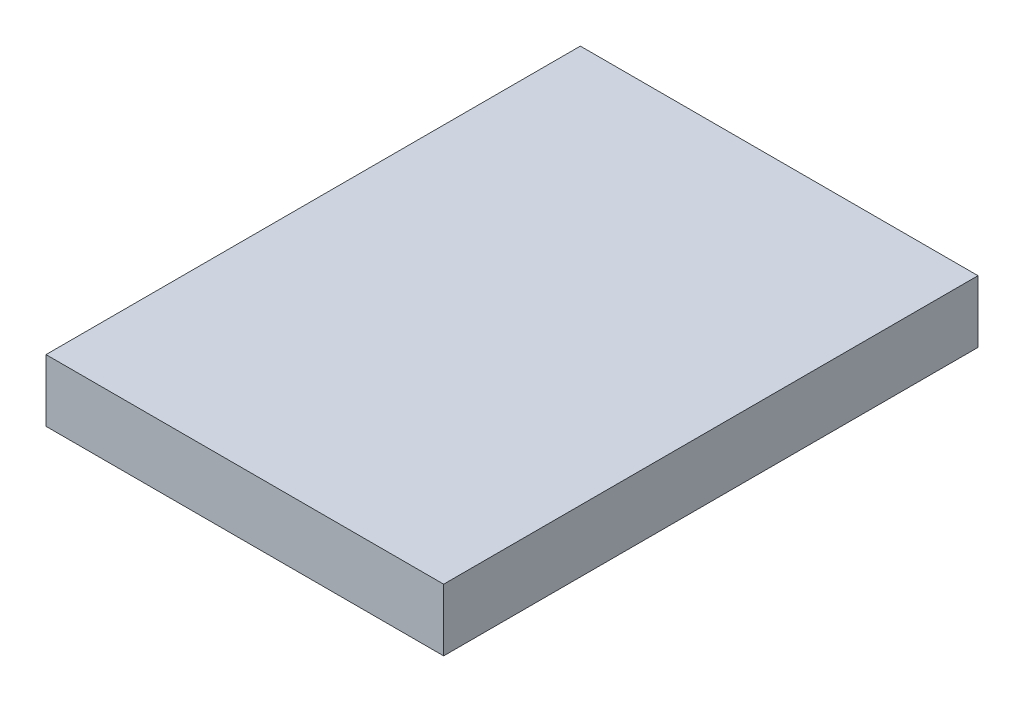
ISO-10303-21;
HEADER;
FILE_DESCRIPTION(('STEP AP214'),'2;1');
FILE_NAME('part.step','',(''),(''),'','','');
FILE_SCHEMA(('AUTOMOTIVE_DESIGN { 1 0 10303 214 1 1 1 1 }'));
ENDSEC;
DATA;
#1=APPLICATION_CONTEXT('core data for automotive mechanical design processes');
#2=APPLICATION_PROTOCOL_DEFINITION('international standard','automotive_design',2000,#1);
#3=PRODUCT_CONTEXT('',#1,'mechanical');
#4=PRODUCT('Part','Part','',(#3));
#5=PRODUCT_RELATED_PRODUCT_CATEGORY('part','',(#4));
#6=PRODUCT_DEFINITION_FORMATION('','',#4);
#7=PRODUCT_DEFINITION_CONTEXT('part definition',#1,'design');
#8=PRODUCT_DEFINITION('design','',#6,#7);
#9=PRODUCT_DEFINITION_SHAPE('','',#8);
#10=(LENGTH_UNIT() NAMED_UNIT(*) SI_UNIT(.MILLI.,.METRE.));
#11=(NAMED_UNIT(*) PLANE_ANGLE_UNIT() SI_UNIT($,.RADIAN.));
#12=(NAMED_UNIT(*) SI_UNIT($,.STERADIAN.) SOLID_ANGLE_UNIT());
#13=UNCERTAINTY_MEASURE_WITH_UNIT(LENGTH_MEASURE(1.E-05),#10,'distance_accuracy_value','');
#14=(GEOMETRIC_REPRESENTATION_CONTEXT(3) GLOBAL_UNCERTAINTY_ASSIGNED_CONTEXT((#13)) GLOBAL_UNIT_ASSIGNED_CONTEXT((#10,
#11,#12)) REPRESENTATION_CONTEXT('',''));
#15=CARTESIAN_POINT('',(0.,0.,0.));
#16=DIRECTION('',(0.,0.,1.));
#17=DIRECTION('',(1.,0.,0.));
#18=AXIS2_PLACEMENT_3D('',#15,#16,#17);
#19=CARTESIAN_POINT('',(0.,7.9375,0.));
#20=DIRECTION('',(1.,0.,0.));
#21=DIRECTION('',(0.,0.,-1.));
#22=AXIS2_PLACEMENT_3D('',#19,#20,#21);
#23=PLANE('',#22);
#24=DIRECTION('',(0.,0.,1.));
#25=VECTOR('',#24,1.);
#26=CARTESIAN_POINT('',(0.,0.,0.));
#27=LINE('',#26,#25);
#28=CARTESIAN_POINT('',(0.,0.,-68.2625));
#29=VERTEX_POINT('',#28);
#30=CARTESIAN_POINT('',(0.,0.,0.));
#31=VERTEX_POINT('',#30);
#32=EDGE_CURVE('E100',#29,#31,#27,.T.);
#33=ORIENTED_EDGE('',*,*,#32,.T.);
#34=DIRECTION('',(0.,-1.,0.));
#35=VECTOR('',#34,1.);
#36=CARTESIAN_POINT('',(0.,7.9375,0.));
#37=LINE('',#36,#35);
#38=CARTESIAN_POINT('',(0.,7.9375,0.));
#39=VERTEX_POINT('',#38);
#40=EDGE_CURVE('E11',#39,#31,#37,.T.);
#41=ORIENTED_EDGE('',*,*,#40,.F.);
#42=DIRECTION('',(0.,0.,1.));
#43=VECTOR('',#42,1.);
#44=CARTESIAN_POINT('',(0.,7.9375,0.));
#45=LINE('',#44,#43);
#46=CARTESIAN_POINT('',(0.,7.9375,-68.2625));
#47=VERTEX_POINT('',#46);
#48=EDGE_CURVE('E88',#47,#39,#45,.T.);
#49=ORIENTED_EDGE('',*,*,#48,.F.);
#50=DIRECTION('',(0.,-1.,0.));
#51=VECTOR('',#50,1.);
#52=CARTESIAN_POINT('',(0.,7.9375,-68.2625));
#53=LINE('',#52,#51);
#54=EDGE_CURVE('E96',#47,#29,#53,.T.);
#55=ORIENTED_EDGE('',*,*,#54,.T.);
#56=EDGE_LOOP('',(#33,#41,#49,#55));
#57=FACE_BOUND('',#56,.T.);
#58=ADVANCED_FACE('F37',(#57),#23,.F.);
#59=CARTESIAN_POINT('',(0.,7.9375,0.));
#60=DIRECTION('',(0.,0.,-1.));
#61=DIRECTION('',(-1.,0.,0.));
#62=AXIS2_PLACEMENT_3D('',#59,#60,#61);
#63=PLANE('',#62);
#64=DIRECTION('',(1.,0.,0.));
#65=VECTOR('',#64,1.);
#66=CARTESIAN_POINT('',(0.,0.,0.));
#67=LINE('',#66,#65);
#68=CARTESIAN_POINT('',(50.8,0.,0.));
#69=VERTEX_POINT('',#68);
#70=EDGE_CURVE('E92',#31,#69,#67,.T.);
#71=ORIENTED_EDGE('',*,*,#70,.T.);
#72=DIRECTION('',(0.,-1.,0.));
#73=VECTOR('',#72,1.);
#74=CARTESIAN_POINT('',(50.8,7.9375,0.));
#75=LINE('',#74,#73);
#76=CARTESIAN_POINT('',(50.8,7.9375,0.));
#77=VERTEX_POINT('',#76);
#78=EDGE_CURVE('E45',#77,#69,#75,.T.);
#79=ORIENTED_EDGE('',*,*,#78,.F.);
#80=DIRECTION('',(1.,0.,0.));
#81=VECTOR('',#80,1.);
#82=CARTESIAN_POINT('',(0.,7.9375,0.));
#83=LINE('',#82,#81);
#84=EDGE_CURVE('E83',#39,#77,#83,.T.);
#85=ORIENTED_EDGE('',*,*,#84,.F.);
#86=ORIENTED_EDGE('',*,*,#40,.T.);
#87=EDGE_LOOP('',(#71,#79,#85,#86));
#88=FACE_BOUND('',#87,.T.);
#89=ADVANCED_FACE('F91',(#88),#63,.F.);
#90=CARTESIAN_POINT('',(50.8,7.9375,0.));
#91=DIRECTION('',(-1.,0.,0.));
#92=DIRECTION('',(0.,0.,1.));
#93=AXIS2_PLACEMENT_3D('',#90,#91,#92);
#94=PLANE('',#93);
#95=DIRECTION('',(0.,0.,-1.));
#96=VECTOR('',#95,1.);
#97=CARTESIAN_POINT('',(50.8,0.,0.));
#98=LINE('',#97,#96);
#99=CARTESIAN_POINT('',(50.8,0.,-68.2625));
#100=VERTEX_POINT('',#99);
#101=EDGE_CURVE('E70',#69,#100,#98,.T.);
#102=ORIENTED_EDGE('',*,*,#101,.T.);
#103=DIRECTION('',(0.,-1.,0.));
#104=VECTOR('',#103,1.);
#105=CARTESIAN_POINT('',(50.8,7.9375,-68.2625));
#106=LINE('',#105,#104);
#107=CARTESIAN_POINT('',(50.8,7.9375,-68.2625));
#108=VERTEX_POINT('',#107);
#109=EDGE_CURVE('E93',#108,#100,#106,.T.);
#110=ORIENTED_EDGE('',*,*,#109,.F.);
#111=DIRECTION('',(0.,0.,-1.));
#112=VECTOR('',#111,1.);
#113=CARTESIAN_POINT('',(50.8,7.9375,0.));
#114=LINE('',#113,#112);
#115=EDGE_CURVE('E86',#77,#108,#114,.T.);
#116=ORIENTED_EDGE('',*,*,#115,.F.);
#117=ORIENTED_EDGE('',*,*,#78,.T.);
#118=EDGE_LOOP('',(#102,#110,#116,#117));
#119=FACE_BOUND('',#118,.T.);
#120=ADVANCED_FACE('F94',(#119),#94,.F.);
#121=CARTESIAN_POINT('',(0.,7.9375,-68.2625));
#122=DIRECTION('',(0.,0.,1.));
#123=DIRECTION('',(1.,0.,0.));
#124=AXIS2_PLACEMENT_3D('',#121,#122,#123);
#125=PLANE('',#124);
#126=DIRECTION('',(-1.,0.,0.));
#127=VECTOR('',#126,1.);
#128=CARTESIAN_POINT('',(0.,0.,-68.2625));
#129=LINE('',#128,#127);
#130=EDGE_CURVE('E76',#100,#29,#129,.T.);
#131=ORIENTED_EDGE('',*,*,#130,.T.);
#132=ORIENTED_EDGE('',*,*,#54,.F.);
#133=DIRECTION('',(-1.,0.,0.));
#134=VECTOR('',#133,1.);
#135=CARTESIAN_POINT('',(0.,7.9375,-68.2625));
#136=LINE('',#135,#134);
#137=EDGE_CURVE('E53',#108,#47,#136,.T.);
#138=ORIENTED_EDGE('',*,*,#137,.F.);
#139=ORIENTED_EDGE('',*,*,#109,.T.);
#140=EDGE_LOOP('',(#131,#132,#138,#139));
#141=FACE_BOUND('',#140,.T.);
#142=ADVANCED_FACE('F107',(#141),#125,.F.);
#143=CARTESIAN_POINT('',(0.,7.9375,0.));
#144=DIRECTION('',(0.,-1.,0.));
#145=DIRECTION('',(0.,0.,-1.));
#146=AXIS2_PLACEMENT_3D('',#143,#144,#145);
#147=PLANE('',#146);
#148=ORIENTED_EDGE('',*,*,#48,.T.);
#149=ORIENTED_EDGE('',*,*,#84,.T.);
#150=ORIENTED_EDGE('',*,*,#115,.T.);
#151=ORIENTED_EDGE('',*,*,#137,.T.);
#152=EDGE_LOOP('',(#148,#149,#150,#151));
#153=FACE_BOUND('',#152,.T.);
#154=ADVANCED_FACE('F84',(#153),#147,.F.);
#155=CARTESIAN_POINT('',(0.,0.,0.));
#156=DIRECTION('',(0.,-1.,0.));
#157=DIRECTION('',(0.,0.,-1.));
#158=AXIS2_PLACEMENT_3D('',#155,#156,#157);
#159=PLANE('',#158);
#160=ORIENTED_EDGE('',*,*,#32,.F.);
#161=ORIENTED_EDGE('',*,*,#130,.F.);
#162=ORIENTED_EDGE('',*,*,#101,.F.);
#163=ORIENTED_EDGE('',*,*,#70,.F.);
#164=EDGE_LOOP('',(#160,#161,#162,#163));
#165=FACE_BOUND('',#164,.T.);
#166=ADVANCED_FACE('F110',(#165),#159,.T.);
#167=CLOSED_SHELL('',(#58,#89,#120,#142,#154,#166));
#168=MANIFOLD_SOLID_BREP('B2',#167);
#169=ADVANCED_BREP_SHAPE_REPRESENTATION('',(#18,#168),#14);
#170=SHAPE_DEFINITION_REPRESENTATION(#9,#169);
ENDSEC;
END-ISO-10303-21;
